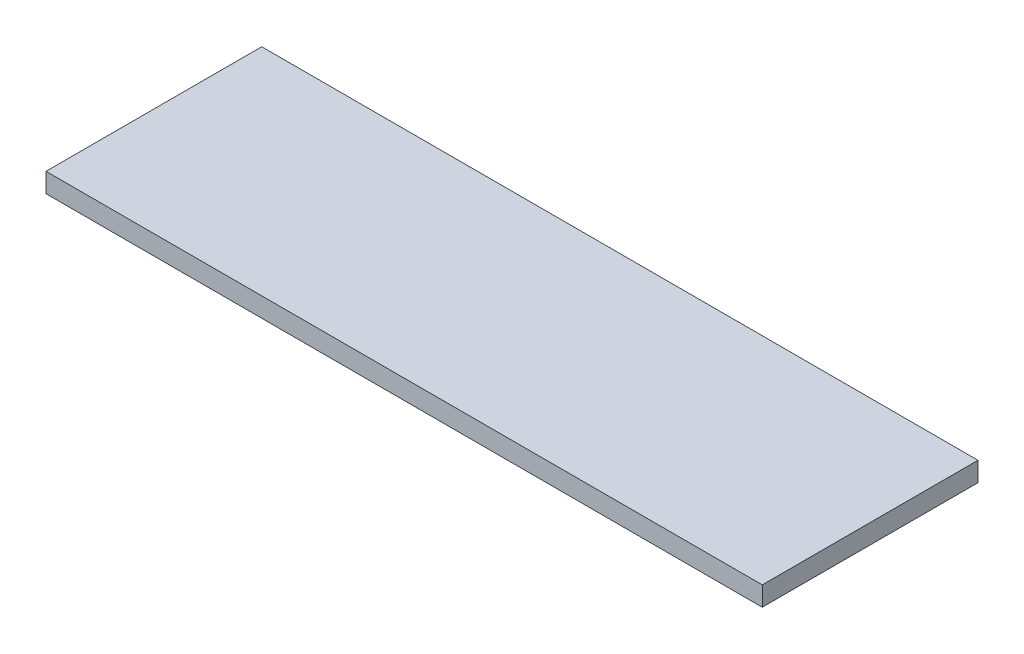
ISO-10303-21;
HEADER;
FILE_DESCRIPTION(('STEP AP214'),'2;1');
FILE_NAME('part.step','',(''),(''),'','','');
FILE_SCHEMA(('AUTOMOTIVE_DESIGN { 1 0 10303 214 1 1 1 1 }'));
ENDSEC;
DATA;
#1=APPLICATION_CONTEXT('core data for automotive mechanical design processes');
#2=APPLICATION_PROTOCOL_DEFINITION('international standard','automotive_design',2000,#1);
#3=PRODUCT_CONTEXT('',#1,'mechanical');
#4=PRODUCT('Part','Part','',(#3));
#5=PRODUCT_RELATED_PRODUCT_CATEGORY('part','',(#4));
#6=PRODUCT_DEFINITION_FORMATION('','',#4);
#7=PRODUCT_DEFINITION_CONTEXT('part definition',#1,'design');
#8=PRODUCT_DEFINITION('design','',#6,#7);
#9=PRODUCT_DEFINITION_SHAPE('','',#8);
#10=(LENGTH_UNIT() NAMED_UNIT(*) SI_UNIT(.MILLI.,.METRE.));
#11=(NAMED_UNIT(*) PLANE_ANGLE_UNIT() SI_UNIT($,.RADIAN.));
#12=(NAMED_UNIT(*) SI_UNIT($,.STERADIAN.) SOLID_ANGLE_UNIT());
#13=UNCERTAINTY_MEASURE_WITH_UNIT(LENGTH_MEASURE(1.E-05),#10,'distance_accuracy_value','');
#14=(GEOMETRIC_REPRESENTATION_CONTEXT(3) GLOBAL_UNCERTAINTY_ASSIGNED_CONTEXT((#13)) GLOBAL_UNIT_ASSIGNED_CONTEXT((#10,
#11,#12)) REPRESENTATION_CONTEXT('',''));
#15=CARTESIAN_POINT('',(0.,0.,0.));
#16=DIRECTION('',(0.,0.,1.));
#17=DIRECTION('',(1.,0.,0.));
#18=AXIS2_PLACEMENT_3D('',#15,#16,#17);
#19=CARTESIAN_POINT('',(0.,1.8,0.));
#20=DIRECTION('',(1.,0.,0.));
#21=DIRECTION('',(0.,0.,-1.));
#22=AXIS2_PLACEMENT_3D('',#19,#20,#21);
#23=PLANE('',#22);
#24=DIRECTION('',(0.,0.,1.));
#25=VECTOR('',#24,1.);
#26=CARTESIAN_POINT('',(0.,0.,0.));
#27=LINE('',#26,#25);
#28=CARTESIAN_POINT('',(0.,0.,-20.));
#29=VERTEX_POINT('',#28);
#30=CARTESIAN_POINT('',(0.,0.,0.));
#31=VERTEX_POINT('',#30);
#32=EDGE_CURVE('E98',#29,#31,#27,.T.);
#33=ORIENTED_EDGE('',*,*,#32,.T.);
#34=DIRECTION('',(0.,-1.,0.));
#35=VECTOR('',#34,1.);
#36=CARTESIAN_POINT('',(0.,1.8,0.));
#37=LINE('',#36,#35);
#38=CARTESIAN_POINT('',(0.,1.8,0.));
#39=VERTEX_POINT('',#38);
#40=EDGE_CURVE('E11',#39,#31,#37,.T.);
#41=ORIENTED_EDGE('',*,*,#40,.F.);
#42=DIRECTION('',(0.,0.,1.));
#43=VECTOR('',#42,1.);
#44=CARTESIAN_POINT('',(0.,1.8,0.));
#45=LINE('',#44,#43);
#46=CARTESIAN_POINT('',(0.,1.8,-20.));
#47=VERTEX_POINT('',#46);
#48=EDGE_CURVE('E86',#47,#39,#45,.T.);
#49=ORIENTED_EDGE('',*,*,#48,.F.);
#50=DIRECTION('',(0.,-1.,0.));
#51=VECTOR('',#50,1.);
#52=CARTESIAN_POINT('',(0.,1.8,-20.));
#53=LINE('',#52,#51);
#54=EDGE_CURVE('E94',#47,#29,#53,.T.);
#55=ORIENTED_EDGE('',*,*,#54,.T.);
#56=EDGE_LOOP('',(#33,#41,#49,#55));
#57=FACE_BOUND('',#56,.T.);
#58=ADVANCED_FACE('F35',(#57),#23,.F.);
#59=CARTESIAN_POINT('',(0.,1.8,0.));
#60=DIRECTION('',(0.,0.,-1.));
#61=DIRECTION('',(-1.,0.,0.));
#62=AXIS2_PLACEMENT_3D('',#59,#60,#61);
#63=PLANE('',#62);
#64=DIRECTION('',(1.,0.,0.));
#65=VECTOR('',#64,1.);
#66=CARTESIAN_POINT('',(0.,0.,0.));
#67=LINE('',#66,#65);
#68=CARTESIAN_POINT('',(66.4,0.,0.));
#69=VERTEX_POINT('',#68);
#70=EDGE_CURVE('E90',#31,#69,#67,.T.);
#71=ORIENTED_EDGE('',*,*,#70,.T.);
#72=DIRECTION('',(0.,-1.,0.));
#73=VECTOR('',#72,1.);
#74=CARTESIAN_POINT('',(66.4,1.8,0.));
#75=LINE('',#74,#73);
#76=CARTESIAN_POINT('',(66.4,1.8,0.));
#77=VERTEX_POINT('',#76);
#78=EDGE_CURVE('E43',#77,#69,#75,.T.);
#79=ORIENTED_EDGE('',*,*,#78,.F.);
#80=DIRECTION('',(1.,0.,0.));
#81=VECTOR('',#80,1.);
#82=CARTESIAN_POINT('',(0.,1.8,0.));
#83=LINE('',#82,#81);
#84=EDGE_CURVE('E81',#39,#77,#83,.T.);
#85=ORIENTED_EDGE('',*,*,#84,.F.);
#86=ORIENTED_EDGE('',*,*,#40,.T.);
#87=EDGE_LOOP('',(#71,#79,#85,#86));
#88=FACE_BOUND('',#87,.T.);
#89=ADVANCED_FACE('F89',(#88),#63,.F.);
#90=CARTESIAN_POINT('',(66.4,1.8,0.));
#91=DIRECTION('',(-1.,0.,0.));
#92=DIRECTION('',(0.,0.,1.));
#93=AXIS2_PLACEMENT_3D('',#90,#91,#92);
#94=PLANE('',#93);
#95=DIRECTION('',(0.,0.,-1.));
#96=VECTOR('',#95,1.);
#97=CARTESIAN_POINT('',(66.4,0.,0.));
#98=LINE('',#97,#96);
#99=CARTESIAN_POINT('',(66.4,0.,-20.));
#100=VERTEX_POINT('',#99);
#101=EDGE_CURVE('E68',#69,#100,#98,.T.);
#102=ORIENTED_EDGE('',*,*,#101,.T.);
#103=DIRECTION('',(0.,-1.,0.));
#104=VECTOR('',#103,1.);
#105=CARTESIAN_POINT('',(66.4,1.8,-20.));
#106=LINE('',#105,#104);
#107=CARTESIAN_POINT('',(66.4,1.8,-20.));
#108=VERTEX_POINT('',#107);
#109=EDGE_CURVE('E91',#108,#100,#106,.T.);
#110=ORIENTED_EDGE('',*,*,#109,.F.);
#111=DIRECTION('',(0.,0.,-1.));
#112=VECTOR('',#111,1.);
#113=CARTESIAN_POINT('',(66.4,1.8,0.));
#114=LINE('',#113,#112);
#115=EDGE_CURVE('E84',#77,#108,#114,.T.);
#116=ORIENTED_EDGE('',*,*,#115,.F.);
#117=ORIENTED_EDGE('',*,*,#78,.T.);
#118=EDGE_LOOP('',(#102,#110,#116,#117));
#119=FACE_BOUND('',#118,.T.);
#120=ADVANCED_FACE('F92',(#119),#94,.F.);
#121=CARTESIAN_POINT('',(0.,1.8,-20.));
#122=DIRECTION('',(0.,0.,1.));
#123=DIRECTION('',(1.,0.,0.));
#124=AXIS2_PLACEMENT_3D('',#121,#122,#123);
#125=PLANE('',#124);
#126=DIRECTION('',(-1.,0.,0.));
#127=VECTOR('',#126,1.);
#128=CARTESIAN_POINT('',(0.,0.,-20.));
#129=LINE('',#128,#127);
#130=EDGE_CURVE('E74',#100,#29,#129,.T.);
#131=ORIENTED_EDGE('',*,*,#130,.T.);
#132=ORIENTED_EDGE('',*,*,#54,.F.);
#133=DIRECTION('',(-1.,0.,0.));
#134=VECTOR('',#133,1.);
#135=CARTESIAN_POINT('',(0.,1.8,-20.));
#136=LINE('',#135,#134);
#137=EDGE_CURVE('E51',#108,#47,#136,.T.);
#138=ORIENTED_EDGE('',*,*,#137,.F.);
#139=ORIENTED_EDGE('',*,*,#109,.T.);
#140=EDGE_LOOP('',(#131,#132,#138,#139));
#141=FACE_BOUND('',#140,.T.);
#142=ADVANCED_FACE('F105',(#141),#125,.F.);
#143=CARTESIAN_POINT('',(0.,1.8,0.));
#144=DIRECTION('',(0.,-1.,0.));
#145=DIRECTION('',(0.,0.,-1.));
#146=AXIS2_PLACEMENT_3D('',#143,#144,#145);
#147=PLANE('',#146);
#148=ORIENTED_EDGE('',*,*,#48,.T.);
#149=ORIENTED_EDGE('',*,*,#84,.T.);
#150=ORIENTED_EDGE('',*,*,#115,.T.);
#151=ORIENTED_EDGE('',*,*,#137,.T.);
#152=EDGE_LOOP('',(#148,#149,#150,#151));
#153=FACE_BOUND('',#152,.T.);
#154=ADVANCED_FACE('F82',(#153),#147,.F.);
#155=CARTESIAN_POINT('',(0.,0.,0.));
#156=DIRECTION('',(0.,-1.,0.));
#157=DIRECTION('',(0.,0.,-1.));
#158=AXIS2_PLACEMENT_3D('',#155,#156,#157);
#159=PLANE('',#158);
#160=ORIENTED_EDGE('',*,*,#32,.F.);
#161=ORIENTED_EDGE('',*,*,#130,.F.);
#162=ORIENTED_EDGE('',*,*,#101,.F.);
#163=ORIENTED_EDGE('',*,*,#70,.F.);
#164=EDGE_LOOP('',(#160,#161,#162,#163));
#165=FACE_BOUND('',#164,.T.);
#166=ADVANCED_FACE('F108',(#165),#159,.T.);
#167=CLOSED_SHELL('',(#58,#89,#120,#142,#154,#166));
#168=MANIFOLD_SOLID_BREP('B2',#167);
#169=ADVANCED_BREP_SHAPE_REPRESENTATION('',(#18,#168),#14);
#170=SHAPE_DEFINITION_REPRESENTATION(#9,#169);
ENDSEC;
END-ISO-10303-21;
